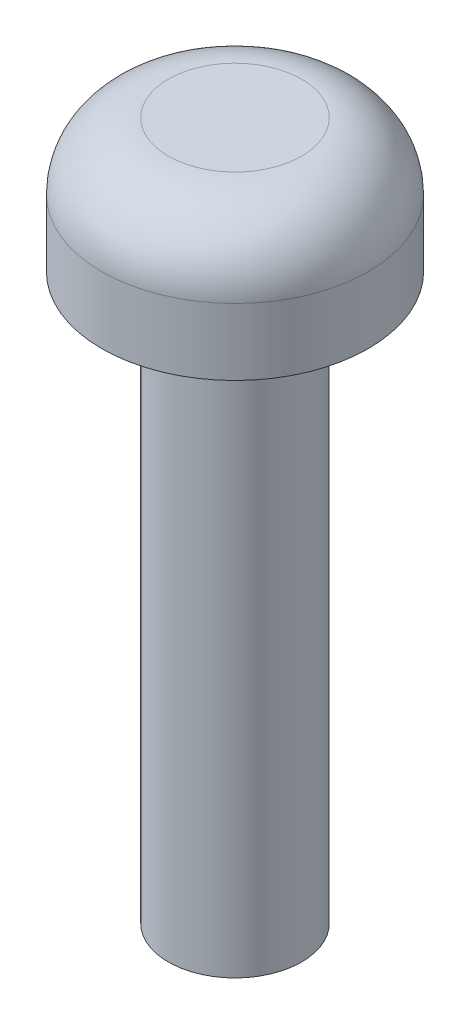
ISO-10303-21;
HEADER;
FILE_DESCRIPTION(('STEP AP214'),'2;1');
FILE_NAME('part.step','',(''),(''),'','','');
FILE_SCHEMA(('AUTOMOTIVE_DESIGN { 1 0 10303 214 1 1 1 1 }'));
ENDSEC;
DATA;
#1=APPLICATION_CONTEXT('core data for automotive mechanical design processes');
#2=APPLICATION_PROTOCOL_DEFINITION('international standard','automotive_design',2000,#1);
#3=PRODUCT_CONTEXT('',#1,'mechanical');
#4=PRODUCT('Part','Part','',(#3));
#5=PRODUCT_RELATED_PRODUCT_CATEGORY('part','',(#4));
#6=PRODUCT_DEFINITION_FORMATION('','',#4);
#7=PRODUCT_DEFINITION_CONTEXT('part definition',#1,'design');
#8=PRODUCT_DEFINITION('design','',#6,#7);
#9=PRODUCT_DEFINITION_SHAPE('','',#8);
#10=(LENGTH_UNIT() NAMED_UNIT(*) SI_UNIT(.MILLI.,.METRE.));
#11=(NAMED_UNIT(*) PLANE_ANGLE_UNIT() SI_UNIT($,.RADIAN.));
#12=(NAMED_UNIT(*) SI_UNIT($,.STERADIAN.) SOLID_ANGLE_UNIT());
#13=UNCERTAINTY_MEASURE_WITH_UNIT(LENGTH_MEASURE(1.E-05),#10,'distance_accuracy_value','');
#14=(GEOMETRIC_REPRESENTATION_CONTEXT(3) GLOBAL_UNCERTAINTY_ASSIGNED_CONTEXT((#13)) GLOBAL_UNIT_ASSIGNED_CONTEXT((#10,
#11,#12)) REPRESENTATION_CONTEXT('',''));
#15=CARTESIAN_POINT('',(0.,0.,0.));
#16=DIRECTION('',(0.,0.,1.));
#17=DIRECTION('',(1.,0.,0.));
#18=AXIS2_PLACEMENT_3D('',#15,#16,#17);
#19=CARTESIAN_POINT('',(0.,3.,0.));
#20=DIRECTION('',(0.,-1.,0.));
#21=DIRECTION('',(0.,0.,-1.));
#22=AXIS2_PLACEMENT_3D('',#19,#20,#21);
#23=CYLINDRICAL_SURFACE('',#22,3.);
#24=CARTESIAN_POINT('',(0.,1.5,0.));
#25=DIRECTION('',(0.,1.,0.));
#26=DIRECTION('',(0.,0.,1.));
#27=AXIS2_PLACEMENT_3D('',#24,#25,#26);
#28=CIRCLE('',#27,3.);
#29=CARTESIAN_POINT('',(0.,1.5,3.));
#30=VERTEX_POINT('',#29);
#31=EDGE_CURVE('E36',#30,#30,#28,.F.);
#32=ORIENTED_EDGE('',*,*,#31,.T.);
#33=EDGE_LOOP('',(#32));
#34=FACE_BOUND('',#33,.T.);
#35=CARTESIAN_POINT('',(0.,0.,0.));
#36=DIRECTION('',(0.,1.,0.));
#37=DIRECTION('',(0.,0.,1.));
#38=AXIS2_PLACEMENT_3D('',#35,#36,#37);
#39=CIRCLE('',#38,3.);
#40=CARTESIAN_POINT('',(0.,0.,3.));
#41=VERTEX_POINT('',#40);
#42=EDGE_CURVE('E48',#41,#41,#39,.T.);
#43=ORIENTED_EDGE('',*,*,#42,.T.);
#44=EDGE_LOOP('',(#43));
#45=FACE_BOUND('',#44,.T.);
#46=ADVANCED_FACE('F32',(#34,#45),#23,.T.);
#47=CARTESIAN_POINT('',(0.,3.,0.));
#48=DIRECTION('',(0.,1.,0.));
#49=DIRECTION('',(0.,0.,1.));
#50=AXIS2_PLACEMENT_3D('',#47,#48,#49);
#51=PLANE('',#50);
#52=CARTESIAN_POINT('',(0.,3.,0.));
#53=DIRECTION('',(0.,1.,0.));
#54=DIRECTION('',(0.,0.,1.));
#55=AXIS2_PLACEMENT_3D('',#52,#53,#54);
#56=CIRCLE('',#55,1.5);
#57=CARTESIAN_POINT('',(0.,3.,1.5));
#58=VERTEX_POINT('',#57);
#59=EDGE_CURVE('E44',#58,#58,#56,.T.);
#60=ORIENTED_EDGE('',*,*,#59,.T.);
#61=EDGE_LOOP('',(#60));
#62=FACE_BOUND('',#61,.T.);
#63=ADVANCED_FACE('F53',(#62),#51,.T.);
#64=CARTESIAN_POINT('',(0.,0.,0.));
#65=DIRECTION('',(0.,1.,0.));
#66=DIRECTION('',(0.,0.,1.));
#67=AXIS2_PLACEMENT_3D('',#64,#65,#66);
#68=PLANE('',#67);
#69=CARTESIAN_POINT('',(0.,0.,0.));
#70=DIRECTION('',(0.,-1.,0.));
#71=DIRECTION('',(0.,0.,-1.));
#72=AXIS2_PLACEMENT_3D('',#69,#70,#71);
#73=CIRCLE('',#72,1.5);
#74=CARTESIAN_POINT('',(0.,0.,-1.5));
#75=VERTEX_POINT('',#74);
#76=EDGE_CURVE('E10',#75,#75,#73,.T.);
#77=ORIENTED_EDGE('',*,*,#76,.F.);
#78=EDGE_LOOP('',(#77));
#79=FACE_BOUND('',#78,.T.);
#80=ORIENTED_EDGE('',*,*,#42,.F.);
#81=EDGE_LOOP('',(#80));
#82=FACE_BOUND('',#81,.T.);
#83=ADVANCED_FACE('F57',(#79,#82),#68,.F.);
#84=CARTESIAN_POINT('',(0.,1.5,0.));
#85=DIRECTION('',(0.,1.,0.));
#86=DIRECTION('',(0.,0.,1.));
#87=AXIS2_PLACEMENT_3D('',#84,#85,#86);
#88=DEGENERATE_TOROIDAL_SURFACE('',#87,1.5,1.5,.T.);
#89=ORIENTED_EDGE('',*,*,#31,.F.);
#90=EDGE_LOOP('',(#89));
#91=FACE_BOUND('',#90,.T.);
#92=ORIENTED_EDGE('',*,*,#59,.F.);
#93=EDGE_LOOP('',(#92));
#94=FACE_BOUND('',#93,.T.);
#95=ADVANCED_FACE('F34',(#91,#94),#88,.T.);
#96=CARTESIAN_POINT('',(0.,-12.7,0.));
#97=DIRECTION('',(0.,1.,0.));
#98=DIRECTION('',(0.,0.,1.));
#99=AXIS2_PLACEMENT_3D('',#96,#97,#98);
#100=CYLINDRICAL_SURFACE('',#99,1.5);
#101=CARTESIAN_POINT('',(0.,-12.7,0.));
#102=DIRECTION('',(0.,-1.,0.));
#103=DIRECTION('',(0.,0.,-1.));
#104=AXIS2_PLACEMENT_3D('',#101,#102,#103);
#105=CIRCLE('',#104,1.5);
#106=CARTESIAN_POINT('',(0.,-12.7,-1.5));
#107=VERTEX_POINT('',#106);
#108=EDGE_CURVE('E47',#107,#107,#105,.T.);
#109=ORIENTED_EDGE('',*,*,#108,.F.);
#110=EDGE_LOOP('',(#109));
#111=FACE_BOUND('',#110,.T.);
#112=ORIENTED_EDGE('',*,*,#76,.T.);
#113=EDGE_LOOP('',(#112));
#114=FACE_BOUND('',#113,.T.);
#115=ADVANCED_FACE('F56',(#111,#114),#100,.T.);
#116=CARTESIAN_POINT('',(0.,-12.7,0.));
#117=DIRECTION('',(0.,-1.,0.));
#118=DIRECTION('',(0.,0.,-1.));
#119=AXIS2_PLACEMENT_3D('',#116,#117,#118);
#120=PLANE('',#119);
#121=ORIENTED_EDGE('',*,*,#108,.T.);
#122=EDGE_LOOP('',(#121));
#123=FACE_BOUND('',#122,.T.);
#124=ADVANCED_FACE('F63',(#123),#120,.T.);
#125=CLOSED_SHELL('',(#46,#63,#83,#95,#115,#124));
#126=MANIFOLD_SOLID_BREP('B2',#125);
#127=ADVANCED_BREP_SHAPE_REPRESENTATION('',(#18,#126),#14);
#128=SHAPE_DEFINITION_REPRESENTATION(#9,#127);
ENDSEC;
END-ISO-10303-21;
